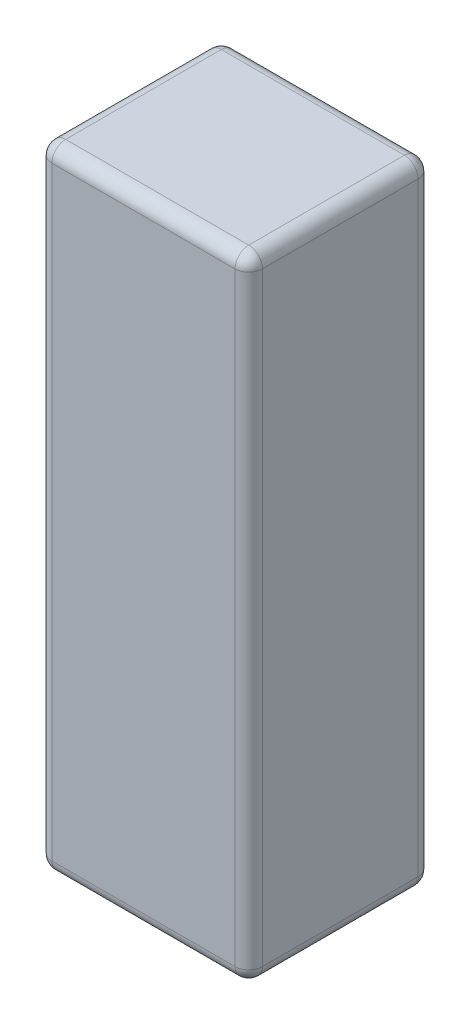
ISO-10303-21;
HEADER;
FILE_DESCRIPTION(('STEP AP214'),'2;1');
FILE_NAME('part.step','',(''),(''),'','','');
FILE_SCHEMA(('AUTOMOTIVE_DESIGN { 1 0 10303 214 1 1 1 1 }'));
ENDSEC;
DATA;
#1=APPLICATION_CONTEXT('core data for automotive mechanical design processes');
#2=APPLICATION_PROTOCOL_DEFINITION('international standard','automotive_design',2000,#1);
#3=PRODUCT_CONTEXT('',#1,'mechanical');
#4=PRODUCT('Part','Part','',(#3));
#5=PRODUCT_RELATED_PRODUCT_CATEGORY('part','',(#4));
#6=PRODUCT_DEFINITION_FORMATION('','',#4);
#7=PRODUCT_DEFINITION_CONTEXT('part definition',#1,'design');
#8=PRODUCT_DEFINITION('design','',#6,#7);
#9=PRODUCT_DEFINITION_SHAPE('','',#8);
#10=(LENGTH_UNIT() NAMED_UNIT(*) SI_UNIT(.MILLI.,.METRE.));
#11=(NAMED_UNIT(*) PLANE_ANGLE_UNIT() SI_UNIT($,.RADIAN.));
#12=(NAMED_UNIT(*) SI_UNIT($,.STERADIAN.) SOLID_ANGLE_UNIT());
#13=UNCERTAINTY_MEASURE_WITH_UNIT(LENGTH_MEASURE(1.E-05),#10,'distance_accuracy_value','');
#14=(GEOMETRIC_REPRESENTATION_CONTEXT(3) GLOBAL_UNCERTAINTY_ASSIGNED_CONTEXT((#13)) GLOBAL_UNIT_ASSIGNED_CONTEXT((#10,
#11,#12)) REPRESENTATION_CONTEXT('',''));
#15=CARTESIAN_POINT('',(0.,0.,0.));
#16=DIRECTION('',(0.,0.,1.));
#17=DIRECTION('',(1.,0.,0.));
#18=AXIS2_PLACEMENT_3D('',#15,#16,#17);
#19=CARTESIAN_POINT('',(23.,138.,20.));
#20=DIRECTION('',(-1.,0.,0.));
#21=DIRECTION('',(0.,0.,1.));
#22=AXIS2_PLACEMENT_3D('',#19,#20,#21);
#23=PLANE('',#22);
#24=DIRECTION('',(0.,0.,-1.));
#25=VECTOR('',#24,1.);
#26=CARTESIAN_POINT('',(23.,135.,20.));
#27=LINE('',#26,#25);
#28=CARTESIAN_POINT('',(23.,135.,-17.));
#29=VERTEX_POINT('',#28);
#30=CARTESIAN_POINT('',(23.,135.,17.));
#31=VERTEX_POINT('',#30);
#32=EDGE_CURVE('E153',#29,#31,#27,.F.);
#33=ORIENTED_EDGE('',*,*,#32,.T.);
#34=DIRECTION('',(0.,-1.,0.));
#35=VECTOR('',#34,1.);
#36=CARTESIAN_POINT('',(23.,138.,17.));
#37=LINE('',#36,#35);
#38=CARTESIAN_POINT('',(23.,3.,17.));
#39=VERTEX_POINT('',#38);
#40=EDGE_CURVE('E156',#31,#39,#37,.T.);
#41=ORIENTED_EDGE('',*,*,#40,.T.);
#42=DIRECTION('',(0.,0.,-1.));
#43=VECTOR('',#42,1.);
#44=CARTESIAN_POINT('',(23.,3.,-20.));
#45=LINE('',#44,#43);
#46=CARTESIAN_POINT('',(23.,3.,-17.));
#47=VERTEX_POINT('',#46);
#48=EDGE_CURVE('E130',#39,#47,#45,.T.);
#49=ORIENTED_EDGE('',*,*,#48,.T.);
#50=DIRECTION('',(0.,-1.,0.));
#51=VECTOR('',#50,1.);
#52=CARTESIAN_POINT('',(23.,138.,-17.));
#53=LINE('',#52,#51);
#54=EDGE_CURVE('E148',#47,#29,#53,.F.);
#55=ORIENTED_EDGE('',*,*,#54,.T.);
#56=EDGE_LOOP('',(#33,#41,#49,#55));
#57=FACE_BOUND('',#56,.T.);
#58=ADVANCED_FACE('F33',(#57),#23,.F.);
#59=CARTESIAN_POINT('',(-23.,138.,-20.));
#60=DIRECTION('',(0.,0.,1.));
#61=DIRECTION('',(1.,0.,0.));
#62=AXIS2_PLACEMENT_3D('',#59,#60,#61);
#63=PLANE('',#62);
#64=DIRECTION('',(-1.,0.,0.));
#65=VECTOR('',#64,1.);
#66=CARTESIAN_POINT('',(-23.,3.,-20.));
#67=LINE('',#66,#65);
#68=CARTESIAN_POINT('',(20.,3.,-20.));
#69=VERTEX_POINT('',#68);
#70=CARTESIAN_POINT('',(-20.,3.,-20.));
#71=VERTEX_POINT('',#70);
#72=EDGE_CURVE('E173',#69,#71,#67,.T.);
#73=ORIENTED_EDGE('',*,*,#72,.T.);
#74=DIRECTION('',(0.,-1.,0.));
#75=VECTOR('',#74,1.);
#76=CARTESIAN_POINT('',(-20.,138.,-20.));
#77=LINE('',#76,#75);
#78=CARTESIAN_POINT('',(-20.,135.,-20.));
#79=VERTEX_POINT('',#78);
#80=EDGE_CURVE('E176',#71,#79,#77,.F.);
#81=ORIENTED_EDGE('',*,*,#80,.T.);
#82=DIRECTION('',(-1.,0.,0.));
#83=VECTOR('',#82,1.);
#84=CARTESIAN_POINT('',(-23.,135.,-20.));
#85=LINE('',#84,#83);
#86=CARTESIAN_POINT('',(20.,135.,-20.));
#87=VERTEX_POINT('',#86);
#88=EDGE_CURVE('E171',#79,#87,#85,.F.);
#89=ORIENTED_EDGE('',*,*,#88,.T.);
#90=DIRECTION('',(0.,-1.,0.));
#91=VECTOR('',#90,1.);
#92=CARTESIAN_POINT('',(20.,138.,-20.));
#93=LINE('',#92,#91);
#94=EDGE_CURVE('E169',#87,#69,#93,.T.);
#95=ORIENTED_EDGE('',*,*,#94,.T.);
#96=EDGE_LOOP('',(#73,#81,#89,#95));
#97=FACE_BOUND('',#96,.T.);
#98=ADVANCED_FACE('F323',(#97),#63,.F.);
#99=CARTESIAN_POINT('',(-23.,138.,20.));
#100=DIRECTION('',(1.,0.,0.));
#101=DIRECTION('',(0.,0.,-1.));
#102=AXIS2_PLACEMENT_3D('',#99,#100,#101);
#103=PLANE('',#102);
#104=DIRECTION('',(0.,0.,1.));
#105=VECTOR('',#104,1.);
#106=CARTESIAN_POINT('',(-23.,3.,20.));
#107=LINE('',#106,#105);
#108=CARTESIAN_POINT('',(-23.,3.,-17.));
#109=VERTEX_POINT('',#108);
#110=CARTESIAN_POINT('',(-23.,3.,17.));
#111=VERTEX_POINT('',#110);
#112=EDGE_CURVE('E182',#109,#111,#107,.T.);
#113=ORIENTED_EDGE('',*,*,#112,.T.);
#114=DIRECTION('',(0.,-1.,0.));
#115=VECTOR('',#114,1.);
#116=CARTESIAN_POINT('',(-23.,138.,17.));
#117=LINE('',#116,#115);
#118=CARTESIAN_POINT('',(-23.,135.,17.));
#119=VERTEX_POINT('',#118);
#120=EDGE_CURVE('E185',#111,#119,#117,.F.);
#121=ORIENTED_EDGE('',*,*,#120,.T.);
#122=DIRECTION('',(0.,0.,1.));
#123=VECTOR('',#122,1.);
#124=CARTESIAN_POINT('',(-23.,135.,20.));
#125=LINE('',#124,#123);
#126=CARTESIAN_POINT('',(-23.,135.,-17.));
#127=VERTEX_POINT('',#126);
#128=EDGE_CURVE('E180',#119,#127,#125,.F.);
#129=ORIENTED_EDGE('',*,*,#128,.T.);
#130=DIRECTION('',(0.,-1.,0.));
#131=VECTOR('',#130,1.);
#132=CARTESIAN_POINT('',(-23.,138.,-17.));
#133=LINE('',#132,#131);
#134=EDGE_CURVE('E178',#127,#109,#133,.T.);
#135=ORIENTED_EDGE('',*,*,#134,.T.);
#136=EDGE_LOOP('',(#113,#121,#129,#135));
#137=FACE_BOUND('',#136,.T.);
#138=ADVANCED_FACE('F293',(#137),#103,.F.);
#139=CARTESIAN_POINT('',(-23.,138.,20.));
#140=DIRECTION('',(0.,0.,-1.));
#141=DIRECTION('',(-1.,0.,0.));
#142=AXIS2_PLACEMENT_3D('',#139,#140,#141);
#143=PLANE('',#142);
#144=DIRECTION('',(1.,0.,0.));
#145=VECTOR('',#144,1.);
#146=CARTESIAN_POINT('',(23.,3.,20.));
#147=LINE('',#146,#145);
#148=CARTESIAN_POINT('',(-20.,3.,20.));
#149=VERTEX_POINT('',#148);
#150=CARTESIAN_POINT('',(20.,3.,20.));
#151=VERTEX_POINT('',#150);
#152=EDGE_CURVE('E191',#149,#151,#147,.T.);
#153=ORIENTED_EDGE('',*,*,#152,.T.);
#154=DIRECTION('',(0.,-1.,0.));
#155=VECTOR('',#154,1.);
#156=CARTESIAN_POINT('',(20.,138.,20.));
#157=LINE('',#156,#155);
#158=CARTESIAN_POINT('',(20.,135.,20.));
#159=VERTEX_POINT('',#158);
#160=EDGE_CURVE('E194',#151,#159,#157,.F.);
#161=ORIENTED_EDGE('',*,*,#160,.T.);
#162=DIRECTION('',(1.,0.,0.));
#163=VECTOR('',#162,1.);
#164=CARTESIAN_POINT('',(-23.,135.,20.));
#165=LINE('',#164,#163);
#166=CARTESIAN_POINT('',(-20.,135.,20.));
#167=VERTEX_POINT('',#166);
#168=EDGE_CURVE('E189',#159,#167,#165,.F.);
#169=ORIENTED_EDGE('',*,*,#168,.T.);
#170=DIRECTION('',(0.,-1.,0.));
#171=VECTOR('',#170,1.);
#172=CARTESIAN_POINT('',(-20.,138.,20.));
#173=LINE('',#172,#171);
#174=EDGE_CURVE('E187',#167,#149,#173,.T.);
#175=ORIENTED_EDGE('',*,*,#174,.T.);
#176=EDGE_LOOP('',(#153,#161,#169,#175));
#177=FACE_BOUND('',#176,.T.);
#178=ADVANCED_FACE('F269',(#177),#143,.F.);
#179=CARTESIAN_POINT('',(0.,138.,0.));
#180=DIRECTION('',(0.,-1.,0.));
#181=DIRECTION('',(0.,0.,-1.));
#182=AXIS2_PLACEMENT_3D('',#179,#180,#181);
#183=PLANE('',#182);
#184=DIRECTION('',(1.,0.,0.));
#185=VECTOR('',#184,1.);
#186=CARTESIAN_POINT('',(0.,138.,17.));
#187=LINE('',#186,#185);
#188=CARTESIAN_POINT('',(-20.,138.,17.));
#189=VERTEX_POINT('',#188);
#190=CARTESIAN_POINT('',(20.,138.,17.));
#191=VERTEX_POINT('',#190);
#192=EDGE_CURVE('E196',#189,#191,#187,.T.);
#193=ORIENTED_EDGE('',*,*,#192,.T.);
#194=DIRECTION('',(0.,0.,-1.));
#195=VECTOR('',#194,1.);
#196=CARTESIAN_POINT('',(20.,138.,0.));
#197=LINE('',#196,#195);
#198=CARTESIAN_POINT('',(20.,138.,-17.));
#199=VERTEX_POINT('',#198);
#200=EDGE_CURVE('E11',#191,#199,#197,.T.);
#201=ORIENTED_EDGE('',*,*,#200,.T.);
#202=DIRECTION('',(-1.,0.,0.));
#203=VECTOR('',#202,1.);
#204=CARTESIAN_POINT('',(0.,138.,-17.));
#205=LINE('',#204,#203);
#206=CARTESIAN_POINT('',(-20.,138.,-17.));
#207=VERTEX_POINT('',#206);
#208=EDGE_CURVE('E42',#199,#207,#205,.T.);
#209=ORIENTED_EDGE('',*,*,#208,.T.);
#210=DIRECTION('',(0.,0.,1.));
#211=VECTOR('',#210,1.);
#212=CARTESIAN_POINT('',(-20.,138.,0.));
#213=LINE('',#212,#211);
#214=EDGE_CURVE('E198',#207,#189,#213,.T.);
#215=ORIENTED_EDGE('',*,*,#214,.T.);
#216=EDGE_LOOP('',(#193,#201,#209,#215));
#217=FACE_BOUND('',#216,.T.);
#218=ADVANCED_FACE('F277',(#217),#183,.F.);
#219=CARTESIAN_POINT('',(0.,0.,0.));
#220=DIRECTION('',(0.,-1.,0.));
#221=DIRECTION('',(0.,0.,-1.));
#222=AXIS2_PLACEMENT_3D('',#219,#220,#221);
#223=PLANE('',#222);
#224=DIRECTION('',(-1.,0.,0.));
#225=VECTOR('',#224,1.);
#226=CARTESIAN_POINT('',(23.,0.,-17.));
#227=LINE('',#226,#225);
#228=CARTESIAN_POINT('',(-20.,0.,-17.));
#229=VERTEX_POINT('',#228);
#230=CARTESIAN_POINT('',(20.,0.,-17.));
#231=VERTEX_POINT('',#230);
#232=EDGE_CURVE('E166',#229,#231,#227,.F.);
#233=ORIENTED_EDGE('',*,*,#232,.T.);
#234=DIRECTION('',(0.,0.,-1.));
#235=VECTOR('',#234,1.);
#236=CARTESIAN_POINT('',(20.,0.,20.));
#237=LINE('',#236,#235);
#238=CARTESIAN_POINT('',(20.,0.,17.));
#239=VERTEX_POINT('',#238);
#240=EDGE_CURVE('E132',#231,#239,#237,.F.);
#241=ORIENTED_EDGE('',*,*,#240,.T.);
#242=DIRECTION('',(1.,0.,0.));
#243=VECTOR('',#242,1.);
#244=CARTESIAN_POINT('',(-23.,0.,17.));
#245=LINE('',#244,#243);
#246=CARTESIAN_POINT('',(-20.,0.,17.));
#247=VERTEX_POINT('',#246);
#248=EDGE_CURVE('E159',#239,#247,#245,.F.);
#249=ORIENTED_EDGE('',*,*,#248,.T.);
#250=DIRECTION('',(0.,0.,1.));
#251=VECTOR('',#250,1.);
#252=CARTESIAN_POINT('',(-20.,0.,-20.));
#253=LINE('',#252,#251);
#254=EDGE_CURVE('E164',#247,#229,#253,.F.);
#255=ORIENTED_EDGE('',*,*,#254,.T.);
#256=EDGE_LOOP('',(#233,#241,#249,#255));
#257=FACE_BOUND('',#256,.T.);
#258=ADVANCED_FACE('F356',(#257),#223,.T.);
#259=CARTESIAN_POINT('',(-20.,135.,0.));
#260=DIRECTION('',(0.,0.,1.));
#261=DIRECTION('',(1.,0.,0.));
#262=AXIS2_PLACEMENT_3D('',#259,#260,#261);
#263=CYLINDRICAL_SURFACE('',#262,3.);
#264=CARTESIAN_POINT('',(-20.,135.,17.));
#265=DIRECTION('',(0.,0.,1.));
#266=DIRECTION('',(1.,0.,0.));
#267=AXIS2_PLACEMENT_3D('',#264,#265,#266);
#268=CIRCLE('',#267,3.);
#269=EDGE_CURVE('E37',#189,#119,#268,.T.);
#270=ORIENTED_EDGE('',*,*,#269,.F.);
#271=ORIENTED_EDGE('',*,*,#214,.F.);
#272=CARTESIAN_POINT('',(-20.,135.,-17.));
#273=DIRECTION('',(0.,0.,-1.));
#274=DIRECTION('',(0.,1.,0.));
#275=AXIS2_PLACEMENT_3D('',#272,#273,#274);
#276=CIRCLE('',#275,3.);
#277=EDGE_CURVE('E247',#127,#207,#276,.T.);
#278=ORIENTED_EDGE('',*,*,#277,.F.);
#279=ORIENTED_EDGE('',*,*,#128,.F.);
#280=EDGE_LOOP('',(#270,#271,#278,#279));
#281=FACE_BOUND('',#280,.T.);
#282=ADVANCED_FACE('F35',(#281),#263,.T.);
#283=CARTESIAN_POINT('',(-20.,135.,17.));
#284=DIRECTION('',(0.,0.,1.));
#285=DIRECTION('',(1.,0.,0.));
#286=AXIS2_PLACEMENT_3D('',#283,#284,#285);
#287=SPHERICAL_SURFACE('',#286,3.);
#288=CARTESIAN_POINT('',(-20.,135.,17.));
#289=DIRECTION('',(-1.,0.,0.));
#290=DIRECTION('',(0.,0.,1.));
#291=AXIS2_PLACEMENT_3D('',#288,#289,#290);
#292=CIRCLE('',#291,3.);
#293=EDGE_CURVE('E242',#189,#167,#292,.F.);
#294=ORIENTED_EDGE('',*,*,#293,.F.);
#295=ORIENTED_EDGE('',*,*,#269,.T.);
#296=CARTESIAN_POINT('',(-20.,135.,17.));
#297=DIRECTION('',(0.,1.,0.));
#298=DIRECTION('',(0.,0.,1.));
#299=AXIS2_PLACEMENT_3D('',#296,#297,#298);
#300=CIRCLE('',#299,3.);
#301=EDGE_CURVE('E245',#167,#119,#300,.F.);
#302=ORIENTED_EDGE('',*,*,#301,.F.);
#303=EDGE_LOOP('',(#294,#295,#302));
#304=FACE_BOUND('',#303,.T.);
#305=ADVANCED_FACE('F258',(#304),#287,.T.);
#306=CARTESIAN_POINT('',(-20.,135.,-17.));
#307=DIRECTION('',(0.,0.,1.));
#308=DIRECTION('',(1.,0.,0.));
#309=AXIS2_PLACEMENT_3D('',#306,#307,#308);
#310=SPHERICAL_SURFACE('',#309,3.);
#311=CARTESIAN_POINT('',(-20.,135.,-17.));
#312=DIRECTION('',(0.,1.,0.));
#313=DIRECTION('',(0.,0.,1.));
#314=AXIS2_PLACEMENT_3D('',#311,#312,#313);
#315=CIRCLE('',#314,3.);
#316=EDGE_CURVE('E236',#127,#79,#315,.F.);
#317=ORIENTED_EDGE('',*,*,#316,.F.);
#318=ORIENTED_EDGE('',*,*,#277,.T.);
#319=CARTESIAN_POINT('',(-20.,135.,-17.));
#320=DIRECTION('',(-1.,0.,0.));
#321=DIRECTION('',(0.,0.,1.));
#322=AXIS2_PLACEMENT_3D('',#319,#320,#321);
#323=CIRCLE('',#322,3.);
#324=EDGE_CURVE('E239',#79,#207,#323,.F.);
#325=ORIENTED_EDGE('',*,*,#324,.F.);
#326=EDGE_LOOP('',(#317,#318,#325));
#327=FACE_BOUND('',#326,.T.);
#328=ADVANCED_FACE('F285',(#327),#310,.T.);
#329=CARTESIAN_POINT('',(-20.,138.,17.));
#330=DIRECTION('',(0.,-1.,0.));
#331=DIRECTION('',(0.,0.,-1.));
#332=AXIS2_PLACEMENT_3D('',#329,#330,#331);
#333=CYLINDRICAL_SURFACE('',#332,3.);
#334=ORIENTED_EDGE('',*,*,#301,.T.);
#335=ORIENTED_EDGE('',*,*,#120,.F.);
#336=CARTESIAN_POINT('',(-20.,3.,17.));
#337=DIRECTION('',(0.,-1.,0.));
#338=DIRECTION('',(0.,0.,-1.));
#339=AXIS2_PLACEMENT_3D('',#336,#337,#338);
#340=CIRCLE('',#339,3.);
#341=EDGE_CURVE('E231',#149,#111,#340,.T.);
#342=ORIENTED_EDGE('',*,*,#341,.F.);
#343=ORIENTED_EDGE('',*,*,#174,.F.);
#344=EDGE_LOOP('',(#334,#335,#342,#343));
#345=FACE_BOUND('',#344,.T.);
#346=ADVANCED_FACE('F265',(#345),#333,.T.);
#347=CARTESIAN_POINT('',(0.,135.,17.));
#348=DIRECTION('',(1.,0.,0.));
#349=DIRECTION('',(0.,0.,-1.));
#350=AXIS2_PLACEMENT_3D('',#347,#348,#349);
#351=CYLINDRICAL_SURFACE('',#350,3.);
#352=ORIENTED_EDGE('',*,*,#293,.T.);
#353=ORIENTED_EDGE('',*,*,#168,.F.);
#354=CARTESIAN_POINT('',(20.,135.,17.));
#355=DIRECTION('',(1.,0.,0.));
#356=DIRECTION('',(0.,0.,-1.));
#357=AXIS2_PLACEMENT_3D('',#354,#355,#356);
#358=CIRCLE('',#357,3.);
#359=EDGE_CURVE('E228',#191,#159,#358,.T.);
#360=ORIENTED_EDGE('',*,*,#359,.F.);
#361=ORIENTED_EDGE('',*,*,#192,.F.);
#362=EDGE_LOOP('',(#352,#353,#360,#361));
#363=FACE_BOUND('',#362,.T.);
#364=ADVANCED_FACE('F275',(#363),#351,.T.);
#365=CARTESIAN_POINT('',(20.,135.,0.));
#366=DIRECTION('',(0.,0.,-1.));
#367=DIRECTION('',(-1.,0.,0.));
#368=AXIS2_PLACEMENT_3D('',#365,#366,#367);
#369=CYLINDRICAL_SURFACE('',#368,3.);
#370=CARTESIAN_POINT('',(20.,135.,-17.));
#371=DIRECTION('',(0.,0.,-1.));
#372=DIRECTION('',(-1.,0.,0.));
#373=AXIS2_PLACEMENT_3D('',#370,#371,#372);
#374=CIRCLE('',#373,3.);
#375=EDGE_CURVE('E223',#199,#29,#374,.T.);
#376=ORIENTED_EDGE('',*,*,#375,.F.);
#377=ORIENTED_EDGE('',*,*,#200,.F.);
#378=CARTESIAN_POINT('',(20.,135.,17.));
#379=DIRECTION('',(0.,0.,1.));
#380=DIRECTION('',(1.,0.,0.));
#381=AXIS2_PLACEMENT_3D('',#378,#379,#380);
#382=CIRCLE('',#381,3.);
#383=EDGE_CURVE('E225',#31,#191,#382,.T.);
#384=ORIENTED_EDGE('',*,*,#383,.F.);
#385=ORIENTED_EDGE('',*,*,#32,.F.);
#386=EDGE_LOOP('',(#376,#377,#384,#385));
#387=FACE_BOUND('',#386,.T.);
#388=ADVANCED_FACE('F280',(#387),#369,.T.);
#389=CARTESIAN_POINT('',(0.,135.,-17.));
#390=DIRECTION('',(-1.,0.,0.));
#391=DIRECTION('',(0.,0.,1.));
#392=AXIS2_PLACEMENT_3D('',#389,#390,#391);
#393=CYLINDRICAL_SURFACE('',#392,3.);
#394=ORIENTED_EDGE('',*,*,#324,.T.);
#395=ORIENTED_EDGE('',*,*,#208,.F.);
#396=CARTESIAN_POINT('',(20.,135.,-17.));
#397=DIRECTION('',(1.,0.,0.));
#398=DIRECTION('',(0.,1.,0.));
#399=AXIS2_PLACEMENT_3D('',#396,#397,#398);
#400=CIRCLE('',#399,3.);
#401=EDGE_CURVE('E50',#87,#199,#400,.T.);
#402=ORIENTED_EDGE('',*,*,#401,.F.);
#403=ORIENTED_EDGE('',*,*,#88,.F.);
#404=EDGE_LOOP('',(#394,#395,#402,#403));
#405=FACE_BOUND('',#404,.T.);
#406=ADVANCED_FACE('F283',(#405),#393,.T.);
#407=CARTESIAN_POINT('',(-20.,138.,-17.));
#408=DIRECTION('',(0.,-1.,0.));
#409=DIRECTION('',(0.,0.,-1.));
#410=AXIS2_PLACEMENT_3D('',#407,#408,#409);
#411=CYLINDRICAL_SURFACE('',#410,3.);
#412=ORIENTED_EDGE('',*,*,#316,.T.);
#413=ORIENTED_EDGE('',*,*,#80,.F.);
#414=CARTESIAN_POINT('',(-20.,3.,-17.));
#415=DIRECTION('',(0.,-1.,0.));
#416=DIRECTION('',(0.,0.,-1.));
#417=AXIS2_PLACEMENT_3D('',#414,#415,#416);
#418=CIRCLE('',#417,3.);
#419=EDGE_CURVE('E219',#109,#71,#418,.T.);
#420=ORIENTED_EDGE('',*,*,#419,.F.);
#421=ORIENTED_EDGE('',*,*,#134,.F.);
#422=EDGE_LOOP('',(#412,#413,#420,#421));
#423=FACE_BOUND('',#422,.T.);
#424=ADVANCED_FACE('F290',(#423),#411,.T.);
#425=CARTESIAN_POINT('',(-20.,3.,20.));
#426=DIRECTION('',(0.,0.,-1.));
#427=DIRECTION('',(-1.,0.,0.));
#428=AXIS2_PLACEMENT_3D('',#425,#426,#427);
#429=CYLINDRICAL_SURFACE('',#428,3.);
#430=CARTESIAN_POINT('',(-20.,3.,17.));
#431=DIRECTION('',(0.,0.,1.));
#432=DIRECTION('',(1.,0.,0.));
#433=AXIS2_PLACEMENT_3D('',#430,#431,#432);
#434=CIRCLE('',#433,3.);
#435=EDGE_CURVE('E233',#111,#247,#434,.T.);
#436=ORIENTED_EDGE('',*,*,#435,.F.);
#437=ORIENTED_EDGE('',*,*,#112,.F.);
#438=CARTESIAN_POINT('',(-20.,3.,-17.));
#439=DIRECTION('',(0.,0.,-1.));
#440=DIRECTION('',(-1.,0.,0.));
#441=AXIS2_PLACEMENT_3D('',#438,#439,#440);
#442=CIRCLE('',#441,3.);
#443=EDGE_CURVE('E216',#229,#109,#442,.T.);
#444=ORIENTED_EDGE('',*,*,#443,.F.);
#445=ORIENTED_EDGE('',*,*,#254,.F.);
#446=EDGE_LOOP('',(#436,#437,#444,#445));
#447=FACE_BOUND('',#446,.T.);
#448=ADVANCED_FACE('F297',(#447),#429,.T.);
#449=CARTESIAN_POINT('',(-20.,3.,17.));
#450=DIRECTION('',(0.,0.,1.));
#451=DIRECTION('',(1.,0.,0.));
#452=AXIS2_PLACEMENT_3D('',#449,#450,#451);
#453=SPHERICAL_SURFACE('',#452,3.);
#454=ORIENTED_EDGE('',*,*,#341,.T.);
#455=ORIENTED_EDGE('',*,*,#435,.T.);
#456=CARTESIAN_POINT('',(-20.,3.,17.));
#457=DIRECTION('',(-1.,0.,0.));
#458=DIRECTION('',(0.,0.,1.));
#459=AXIS2_PLACEMENT_3D('',#456,#457,#458);
#460=CIRCLE('',#459,3.);
#461=EDGE_CURVE('E213',#149,#247,#460,.F.);
#462=ORIENTED_EDGE('',*,*,#461,.F.);
#463=EDGE_LOOP('',(#454,#455,#462));
#464=FACE_BOUND('',#463,.T.);
#465=ADVANCED_FACE('F301',(#464),#453,.T.);
#466=CARTESIAN_POINT('',(20.,135.,17.));
#467=DIRECTION('',(0.,0.,1.));
#468=DIRECTION('',(1.,0.,0.));
#469=AXIS2_PLACEMENT_3D('',#466,#467,#468);
#470=SPHERICAL_SURFACE('',#469,3.);
#471=ORIENTED_EDGE('',*,*,#383,.T.);
#472=ORIENTED_EDGE('',*,*,#359,.T.);
#473=CARTESIAN_POINT('',(20.,135.,17.));
#474=DIRECTION('',(0.,1.,0.));
#475=DIRECTION('',(0.,0.,1.));
#476=AXIS2_PLACEMENT_3D('',#473,#474,#475);
#477=CIRCLE('',#476,3.);
#478=EDGE_CURVE('E210',#31,#159,#477,.F.);
#479=ORIENTED_EDGE('',*,*,#478,.F.);
#480=EDGE_LOOP('',(#471,#472,#479));
#481=FACE_BOUND('',#480,.T.);
#482=ADVANCED_FACE('F311',(#481),#470,.T.);
#483=CARTESIAN_POINT('',(20.,135.,-17.));
#484=DIRECTION('',(0.,0.,1.));
#485=DIRECTION('',(1.,0.,0.));
#486=AXIS2_PLACEMENT_3D('',#483,#484,#485);
#487=SPHERICAL_SURFACE('',#486,3.);
#488=ORIENTED_EDGE('',*,*,#401,.T.);
#489=ORIENTED_EDGE('',*,*,#375,.T.);
#490=CARTESIAN_POINT('',(20.,135.,-17.));
#491=DIRECTION('',(0.,1.,0.));
#492=DIRECTION('',(0.,0.,1.));
#493=AXIS2_PLACEMENT_3D('',#490,#491,#492);
#494=CIRCLE('',#493,3.);
#495=EDGE_CURVE('E150',#87,#29,#494,.F.);
#496=ORIENTED_EDGE('',*,*,#495,.F.);
#497=EDGE_LOOP('',(#488,#489,#496));
#498=FACE_BOUND('',#497,.T.);
#499=ADVANCED_FACE('F313',(#498),#487,.T.);
#500=CARTESIAN_POINT('',(-20.,3.,-17.));
#501=DIRECTION('',(0.,0.,1.));
#502=DIRECTION('',(1.,0.,0.));
#503=AXIS2_PLACEMENT_3D('',#500,#501,#502);
#504=SPHERICAL_SURFACE('',#503,3.);
#505=ORIENTED_EDGE('',*,*,#443,.T.);
#506=ORIENTED_EDGE('',*,*,#419,.T.);
#507=CARTESIAN_POINT('',(-20.,3.,-17.));
#508=DIRECTION('',(-1.,0.,0.));
#509=DIRECTION('',(0.,0.,1.));
#510=AXIS2_PLACEMENT_3D('',#507,#508,#509);
#511=CIRCLE('',#510,3.);
#512=EDGE_CURVE('E207',#229,#71,#511,.F.);
#513=ORIENTED_EDGE('',*,*,#512,.F.);
#514=EDGE_LOOP('',(#505,#506,#513));
#515=FACE_BOUND('',#514,.T.);
#516=ADVANCED_FACE('F319',(#515),#504,.T.);
#517=CARTESIAN_POINT('',(-23.,3.,17.));
#518=DIRECTION('',(-1.,0.,0.));
#519=DIRECTION('',(0.,0.,1.));
#520=AXIS2_PLACEMENT_3D('',#517,#518,#519);
#521=CYLINDRICAL_SURFACE('',#520,3.);
#522=ORIENTED_EDGE('',*,*,#461,.T.);
#523=ORIENTED_EDGE('',*,*,#248,.F.);
#524=CARTESIAN_POINT('',(20.,3.,17.));
#525=DIRECTION('',(1.,0.,0.));
#526=DIRECTION('',(0.,0.,-1.));
#527=AXIS2_PLACEMENT_3D('',#524,#525,#526);
#528=CIRCLE('',#527,3.);
#529=EDGE_CURVE('E204',#151,#239,#528,.T.);
#530=ORIENTED_EDGE('',*,*,#529,.F.);
#531=ORIENTED_EDGE('',*,*,#152,.F.);
#532=EDGE_LOOP('',(#522,#523,#530,#531));
#533=FACE_BOUND('',#532,.T.);
#534=ADVANCED_FACE('F304',(#533),#521,.T.);
#535=CARTESIAN_POINT('',(20.,138.,17.));
#536=DIRECTION('',(0.,-1.,0.));
#537=DIRECTION('',(0.,0.,-1.));
#538=AXIS2_PLACEMENT_3D('',#535,#536,#537);
#539=CYLINDRICAL_SURFACE('',#538,3.);
#540=ORIENTED_EDGE('',*,*,#478,.T.);
#541=ORIENTED_EDGE('',*,*,#160,.F.);
#542=CARTESIAN_POINT('',(20.,3.,17.));
#543=DIRECTION('',(0.,-1.,0.));
#544=DIRECTION('',(0.,0.,-1.));
#545=AXIS2_PLACEMENT_3D('',#542,#543,#544);
#546=CIRCLE('',#545,3.);
#547=EDGE_CURVE('E145',#39,#151,#546,.T.);
#548=ORIENTED_EDGE('',*,*,#547,.F.);
#549=ORIENTED_EDGE('',*,*,#40,.F.);
#550=EDGE_LOOP('',(#540,#541,#548,#549));
#551=FACE_BOUND('',#550,.T.);
#552=ADVANCED_FACE('F309',(#551),#539,.T.);
#553=CARTESIAN_POINT('',(20.,138.,-17.));
#554=DIRECTION('',(0.,-1.,0.));
#555=DIRECTION('',(0.,0.,-1.));
#556=AXIS2_PLACEMENT_3D('',#553,#554,#555);
#557=CYLINDRICAL_SURFACE('',#556,3.);
#558=ORIENTED_EDGE('',*,*,#495,.T.);
#559=ORIENTED_EDGE('',*,*,#54,.F.);
#560=CARTESIAN_POINT('',(20.,3.,-17.));
#561=DIRECTION('',(0.,-1.,0.));
#562=DIRECTION('',(0.,0.,-1.));
#563=AXIS2_PLACEMENT_3D('',#560,#561,#562);
#564=CIRCLE('',#563,3.);
#565=EDGE_CURVE('E138',#69,#47,#564,.T.);
#566=ORIENTED_EDGE('',*,*,#565,.F.);
#567=ORIENTED_EDGE('',*,*,#94,.F.);
#568=EDGE_LOOP('',(#558,#559,#566,#567));
#569=FACE_BOUND('',#568,.T.);
#570=ADVANCED_FACE('F149',(#569),#557,.T.);
#571=CARTESIAN_POINT('',(-23.,3.,-17.));
#572=DIRECTION('',(1.,0.,0.));
#573=DIRECTION('',(0.,0.,-1.));
#574=AXIS2_PLACEMENT_3D('',#571,#572,#573);
#575=CYLINDRICAL_SURFACE('',#574,3.);
#576=ORIENTED_EDGE('',*,*,#512,.T.);
#577=ORIENTED_EDGE('',*,*,#72,.F.);
#578=CARTESIAN_POINT('',(20.,3.,-17.));
#579=DIRECTION('',(1.,0.,0.));
#580=DIRECTION('',(0.,0.,-1.));
#581=AXIS2_PLACEMENT_3D('',#578,#579,#580);
#582=CIRCLE('',#581,3.);
#583=EDGE_CURVE('E142',#231,#69,#582,.T.);
#584=ORIENTED_EDGE('',*,*,#583,.F.);
#585=ORIENTED_EDGE('',*,*,#232,.F.);
#586=EDGE_LOOP('',(#576,#577,#584,#585));
#587=FACE_BOUND('',#586,.T.);
#588=ADVANCED_FACE('F339',(#587),#575,.T.);
#589=CARTESIAN_POINT('',(20.,3.,17.));
#590=DIRECTION('',(0.,0.,1.));
#591=DIRECTION('',(1.,0.,0.));
#592=AXIS2_PLACEMENT_3D('',#589,#590,#591);
#593=SPHERICAL_SURFACE('',#592,3.);
#594=ORIENTED_EDGE('',*,*,#547,.T.);
#595=ORIENTED_EDGE('',*,*,#529,.T.);
#596=CARTESIAN_POINT('',(20.,3.,17.));
#597=DIRECTION('',(0.,0.,1.));
#598=DIRECTION('',(1.,0.,0.));
#599=AXIS2_PLACEMENT_3D('',#596,#597,#598);
#600=CIRCLE('',#599,3.);
#601=EDGE_CURVE('E135',#39,#239,#600,.F.);
#602=ORIENTED_EDGE('',*,*,#601,.F.);
#603=EDGE_LOOP('',(#594,#595,#602));
#604=FACE_BOUND('',#603,.T.);
#605=ADVANCED_FACE('F336',(#604),#593,.T.);
#606=CARTESIAN_POINT('',(20.,3.,-17.));
#607=DIRECTION('',(0.,0.,1.));
#608=DIRECTION('',(1.,0.,0.));
#609=AXIS2_PLACEMENT_3D('',#606,#607,#608);
#610=SPHERICAL_SURFACE('',#609,3.);
#611=ORIENTED_EDGE('',*,*,#583,.T.);
#612=ORIENTED_EDGE('',*,*,#565,.T.);
#613=CARTESIAN_POINT('',(20.,3.,-17.));
#614=DIRECTION('',(0.,0.,-1.));
#615=DIRECTION('',(-1.,0.,0.));
#616=AXIS2_PLACEMENT_3D('',#613,#614,#615);
#617=CIRCLE('',#616,3.);
#618=EDGE_CURVE('E126',#231,#47,#617,.F.);
#619=ORIENTED_EDGE('',*,*,#618,.F.);
#620=EDGE_LOOP('',(#611,#612,#619));
#621=FACE_BOUND('',#620,.T.);
#622=ADVANCED_FACE('F140',(#621),#610,.T.);
#623=CARTESIAN_POINT('',(20.,3.,20.));
#624=DIRECTION('',(0.,0.,1.));
#625=DIRECTION('',(1.,0.,0.));
#626=AXIS2_PLACEMENT_3D('',#623,#624,#625);
#627=CYLINDRICAL_SURFACE('',#626,3.);
#628=ORIENTED_EDGE('',*,*,#601,.T.);
#629=ORIENTED_EDGE('',*,*,#240,.F.);
#630=ORIENTED_EDGE('',*,*,#618,.T.);
#631=ORIENTED_EDGE('',*,*,#48,.F.);
#632=EDGE_LOOP('',(#628,#629,#630,#631));
#633=FACE_BOUND('',#632,.T.);
#634=ADVANCED_FACE('F128',(#633),#627,.T.);
#635=CLOSED_SHELL('',(#58,#98,#138,#178,#218,#258,#282,#305,#328,#346,#364,#388,#406,#424,#448,
#465,#482,#499,#516,#534,#552,#570,#588,#605,#622,#634));
#636=MANIFOLD_SOLID_BREP('B2',#635);
#637=ADVANCED_BREP_SHAPE_REPRESENTATION('',(#18,#636),#14);
#638=SHAPE_DEFINITION_REPRESENTATION(#9,#637);
ENDSEC;
END-ISO-10303-21;
